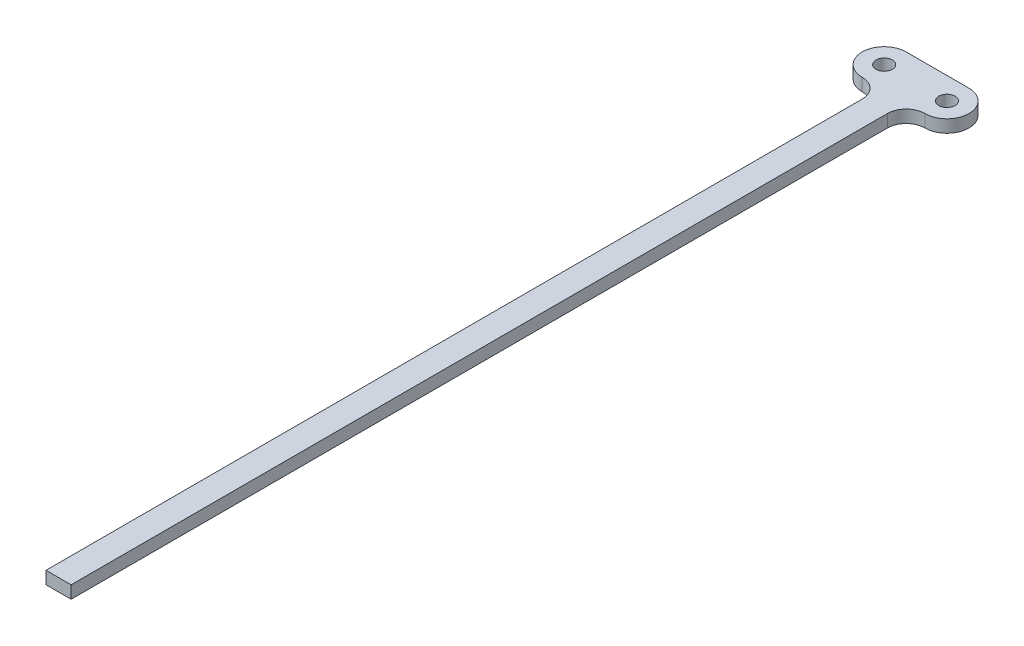
ISO-10303-21;
HEADER;
FILE_DESCRIPTION(('STEP AP214'),'2;1');
FILE_NAME('part.step','',(''),(''),'','','');
FILE_SCHEMA(('AUTOMOTIVE_DESIGN { 1 0 10303 214 1 1 1 1 }'));
ENDSEC;
DATA;
#1=APPLICATION_CONTEXT('core data for automotive mechanical design processes');
#2=APPLICATION_PROTOCOL_DEFINITION('international standard','automotive_design',2000,#1);
#3=PRODUCT_CONTEXT('',#1,'mechanical');
#4=PRODUCT('Part','Part','',(#3));
#5=PRODUCT_RELATED_PRODUCT_CATEGORY('part','',(#4));
#6=PRODUCT_DEFINITION_FORMATION('','',#4);
#7=PRODUCT_DEFINITION_CONTEXT('part definition',#1,'design');
#8=PRODUCT_DEFINITION('design','',#6,#7);
#9=PRODUCT_DEFINITION_SHAPE('','',#8);
#10=(LENGTH_UNIT() NAMED_UNIT(*) SI_UNIT(.MILLI.,.METRE.));
#11=(NAMED_UNIT(*) PLANE_ANGLE_UNIT() SI_UNIT($,.RADIAN.));
#12=(NAMED_UNIT(*) SI_UNIT($,.STERADIAN.) SOLID_ANGLE_UNIT());
#13=UNCERTAINTY_MEASURE_WITH_UNIT(LENGTH_MEASURE(1.E-05),#10,'distance_accuracy_value','');
#14=(GEOMETRIC_REPRESENTATION_CONTEXT(3) GLOBAL_UNCERTAINTY_ASSIGNED_CONTEXT((#13)) GLOBAL_UNIT_ASSIGNED_CONTEXT((#10,
#11,#12)) REPRESENTATION_CONTEXT('',''));
#15=CARTESIAN_POINT('',(0.,0.,0.));
#16=DIRECTION('',(0.,0.,1.));
#17=DIRECTION('',(1.,0.,0.));
#18=AXIS2_PLACEMENT_3D('',#15,#16,#17);
#19=CARTESIAN_POINT('',(-3.81,2.54,-165.1));
#20=DIRECTION('',(0.,1.,0.));
#21=DIRECTION('',(0.,0.,1.));
#22=AXIS2_PLACEMENT_3D('',#19,#20,#21);
#23=PLANE('',#22);
#24=CARTESIAN_POINT('',(8.89,2.54,-173.355));
#25=DIRECTION('',(0.,1.,0.));
#26=DIRECTION('',(0.,0.,1.));
#27=AXIS2_PLACEMENT_3D('',#24,#25,#26);
#28=CIRCLE('',#27,1.65099999999999);
#29=CARTESIAN_POINT('',(8.89,2.54,-171.704));
#30=VERTEX_POINT('',#29);
#31=EDGE_CURVE('E146',#30,#30,#28,.T.);
#32=ORIENTED_EDGE('',*,*,#31,.F.);
#33=EDGE_LOOP('',(#32));
#34=FACE_BOUND('',#33,.T.);
#35=DIRECTION('',(0.,0.,1.));
#36=VECTOR('',#35,1.);
#37=CARTESIAN_POINT('',(0.,2.54,0.));
#38=LINE('',#37,#36);
#39=CARTESIAN_POINT('',(0.,2.54,-165.1));
#40=VERTEX_POINT('',#39);
#41=CARTESIAN_POINT('',(0.,2.54,0.));
#42=VERTEX_POINT('',#41);
#43=EDGE_CURVE('E164',#40,#42,#38,.T.);
#44=ORIENTED_EDGE('',*,*,#43,.T.);
#45=DIRECTION('',(1.,0.,0.));
#46=VECTOR('',#45,1.);
#47=CARTESIAN_POINT('',(0.,2.54,0.));
#48=LINE('',#47,#46);
#49=CARTESIAN_POINT('',(5.08,2.54,0.));
#50=VERTEX_POINT('',#49);
#51=EDGE_CURVE('E100',#42,#50,#48,.T.);
#52=ORIENTED_EDGE('',*,*,#51,.T.);
#53=DIRECTION('',(0.,0.,-1.));
#54=VECTOR('',#53,1.);
#55=CARTESIAN_POINT('',(5.08,2.54,0.));
#56=LINE('',#55,#54);
#57=CARTESIAN_POINT('',(5.08,2.54,-165.1));
#58=VERTEX_POINT('',#57);
#59=EDGE_CURVE('E185',#50,#58,#56,.T.);
#60=ORIENTED_EDGE('',*,*,#59,.T.);
#61=CARTESIAN_POINT('',(8.89,2.54,-165.1));
#62=DIRECTION('',(0.,-1.,0.));
#63=DIRECTION('',(0.,0.,-1.));
#64=AXIS2_PLACEMENT_3D('',#61,#62,#63);
#65=CIRCLE('',#64,3.81);
#66=CARTESIAN_POINT('',(8.89,2.54,-168.91));
#67=VERTEX_POINT('',#66);
#68=EDGE_CURVE('E199',#58,#67,#65,.T.);
#69=ORIENTED_EDGE('',*,*,#68,.T.);
#70=CARTESIAN_POINT('',(8.89,2.54,-173.355));
#71=DIRECTION('',(0.,1.,0.));
#72=DIRECTION('',(0.,0.,1.));
#73=AXIS2_PLACEMENT_3D('',#70,#71,#72);
#74=CIRCLE('',#73,4.44499999999999);
#75=CARTESIAN_POINT('',(8.89,2.54,-177.8));
#76=VERTEX_POINT('',#75);
#77=EDGE_CURVE('E119',#67,#76,#74,.T.);
#78=ORIENTED_EDGE('',*,*,#77,.T.);
#79=DIRECTION('',(-1.,0.,0.));
#80=VECTOR('',#79,1.);
#81=CARTESIAN_POINT('',(-3.81,2.54,-177.8));
#82=LINE('',#81,#80);
#83=CARTESIAN_POINT('',(-3.81,2.54,-177.8));
#84=VERTEX_POINT('',#83);
#85=EDGE_CURVE('E113',#76,#84,#82,.T.);
#86=ORIENTED_EDGE('',*,*,#85,.T.);
#87=CARTESIAN_POINT('',(-3.81,2.54,-173.355));
#88=DIRECTION('',(0.,1.,0.));
#89=DIRECTION('',(0.,0.,-1.));
#90=AXIS2_PLACEMENT_3D('',#87,#88,#89);
#91=CIRCLE('',#90,4.44499999999999);
#92=CARTESIAN_POINT('',(-3.81,2.54,-168.91));
#93=VERTEX_POINT('',#92);
#94=EDGE_CURVE('E117',#84,#93,#91,.T.);
#95=ORIENTED_EDGE('',*,*,#94,.T.);
#96=CARTESIAN_POINT('',(-3.81,2.54,-165.1));
#97=DIRECTION('',(0.,-1.,0.));
#98=DIRECTION('',(0.,0.,1.));
#99=AXIS2_PLACEMENT_3D('',#96,#97,#98);
#100=CIRCLE('',#99,3.81);
#101=EDGE_CURVE('E57',#93,#40,#100,.T.);
#102=ORIENTED_EDGE('',*,*,#101,.T.);
#103=EDGE_LOOP('',(#44,#52,#60,#69,#78,#86,#95,#102));
#104=FACE_BOUND('',#103,.T.);
#105=CARTESIAN_POINT('',(-3.81,2.54,-173.355));
#106=DIRECTION('',(0.,1.,0.));
#107=DIRECTION('',(0.,0.,1.));
#108=AXIS2_PLACEMENT_3D('',#105,#106,#107);
#109=CIRCLE('',#108,1.651);
#110=CARTESIAN_POINT('',(-3.81,2.54,-171.704));
#111=VERTEX_POINT('',#110);
#112=EDGE_CURVE('E213',#111,#111,#109,.T.);
#113=ORIENTED_EDGE('',*,*,#112,.F.);
#114=EDGE_LOOP('',(#113));
#115=FACE_BOUND('',#114,.T.);
#116=ADVANCED_FACE('F39',(#34,#104,#115),#23,.T.);
#117=CARTESIAN_POINT('',(-3.81,0.,-165.1));
#118=DIRECTION('',(0.,1.,0.));
#119=DIRECTION('',(0.,0.,1.));
#120=AXIS2_PLACEMENT_3D('',#117,#118,#119);
#121=PLANE('',#120);
#122=DIRECTION('',(0.,0.,1.));
#123=VECTOR('',#122,1.);
#124=CARTESIAN_POINT('',(0.,0.,0.));
#125=LINE('',#124,#123);
#126=CARTESIAN_POINT('',(0.,0.,-165.1));
#127=VERTEX_POINT('',#126);
#128=CARTESIAN_POINT('',(0.,0.,0.));
#129=VERTEX_POINT('',#128);
#130=EDGE_CURVE('E141',#127,#129,#125,.T.);
#131=ORIENTED_EDGE('',*,*,#130,.F.);
#132=CARTESIAN_POINT('',(-3.81,0.,-165.1));
#133=DIRECTION('',(0.,-1.,0.));
#134=DIRECTION('',(0.,0.,1.));
#135=AXIS2_PLACEMENT_3D('',#132,#133,#134);
#136=CIRCLE('',#135,3.81);
#137=CARTESIAN_POINT('',(-3.81,0.,-168.91));
#138=VERTEX_POINT('',#137);
#139=EDGE_CURVE('E92',#138,#127,#136,.T.);
#140=ORIENTED_EDGE('',*,*,#139,.F.);
#141=CARTESIAN_POINT('',(-3.81,0.,-173.355));
#142=DIRECTION('',(0.,1.,0.));
#143=DIRECTION('',(0.,0.,-1.));
#144=AXIS2_PLACEMENT_3D('',#141,#142,#143);
#145=CIRCLE('',#144,4.44499999999999);
#146=CARTESIAN_POINT('',(-3.81,0.,-177.8));
#147=VERTEX_POINT('',#146);
#148=EDGE_CURVE('E86',#147,#138,#145,.T.);
#149=ORIENTED_EDGE('',*,*,#148,.F.);
#150=DIRECTION('',(-1.,0.,0.));
#151=VECTOR('',#150,1.);
#152=CARTESIAN_POINT('',(-3.81,0.,-177.8));
#153=LINE('',#152,#151);
#154=CARTESIAN_POINT('',(8.89,0.,-177.8));
#155=VERTEX_POINT('',#154);
#156=EDGE_CURVE('E128',#155,#147,#153,.T.);
#157=ORIENTED_EDGE('',*,*,#156,.F.);
#158=CARTESIAN_POINT('',(8.89,0.,-173.355));
#159=DIRECTION('',(0.,1.,0.));
#160=DIRECTION('',(0.,0.,1.));
#161=AXIS2_PLACEMENT_3D('',#158,#159,#160);
#162=CIRCLE('',#161,4.44499999999999);
#163=CARTESIAN_POINT('',(8.89,0.,-168.91));
#164=VERTEX_POINT('',#163);
#165=EDGE_CURVE('E155',#164,#155,#162,.T.);
#166=ORIENTED_EDGE('',*,*,#165,.F.);
#167=CARTESIAN_POINT('',(8.89,0.,-165.1));
#168=DIRECTION('',(0.,-1.,0.));
#169=DIRECTION('',(0.,0.,-1.));
#170=AXIS2_PLACEMENT_3D('',#167,#168,#169);
#171=CIRCLE('',#170,3.81);
#172=CARTESIAN_POINT('',(5.08,0.,-165.1));
#173=VERTEX_POINT('',#172);
#174=EDGE_CURVE('E152',#173,#164,#171,.T.);
#175=ORIENTED_EDGE('',*,*,#174,.F.);
#176=DIRECTION('',(0.,0.,-1.));
#177=VECTOR('',#176,1.);
#178=CARTESIAN_POINT('',(5.08,0.,0.));
#179=LINE('',#178,#177);
#180=CARTESIAN_POINT('',(5.08,0.,0.));
#181=VERTEX_POINT('',#180);
#182=EDGE_CURVE('E149',#181,#173,#179,.T.);
#183=ORIENTED_EDGE('',*,*,#182,.F.);
#184=DIRECTION('',(1.,0.,0.));
#185=VECTOR('',#184,1.);
#186=CARTESIAN_POINT('',(0.,0.,0.));
#187=LINE('',#186,#185);
#188=EDGE_CURVE('E145',#129,#181,#187,.T.);
#189=ORIENTED_EDGE('',*,*,#188,.F.);
#190=EDGE_LOOP('',(#131,#140,#149,#157,#166,#175,#183,#189));
#191=FACE_BOUND('',#190,.T.);
#192=CARTESIAN_POINT('',(8.89,0.,-173.355));
#193=DIRECTION('',(0.,1.,0.));
#194=DIRECTION('',(0.,0.,1.));
#195=AXIS2_PLACEMENT_3D('',#192,#193,#194);
#196=CIRCLE('',#195,1.65099999999999);
#197=CARTESIAN_POINT('',(8.89,0.,-171.704));
#198=VERTEX_POINT('',#197);
#199=EDGE_CURVE('E209',#198,#198,#196,.T.);
#200=ORIENTED_EDGE('',*,*,#199,.T.);
#201=EDGE_LOOP('',(#200));
#202=FACE_BOUND('',#201,.T.);
#203=CARTESIAN_POINT('',(-3.81,0.,-173.355));
#204=DIRECTION('',(0.,1.,0.));
#205=DIRECTION('',(0.,0.,1.));
#206=AXIS2_PLACEMENT_3D('',#203,#204,#205);
#207=CIRCLE('',#206,1.651);
#208=CARTESIAN_POINT('',(-3.81,0.,-171.704));
#209=VERTEX_POINT('',#208);
#210=EDGE_CURVE('E217',#209,#209,#207,.T.);
#211=ORIENTED_EDGE('',*,*,#210,.T.);
#212=EDGE_LOOP('',(#211));
#213=FACE_BOUND('',#212,.T.);
#214=ADVANCED_FACE('F189',(#191,#202,#213),#121,.F.);
#215=CARTESIAN_POINT('',(0.,2.54,0.));
#216=DIRECTION('',(1.,0.,0.));
#217=DIRECTION('',(0.,0.,-1.));
#218=AXIS2_PLACEMENT_3D('',#215,#216,#217);
#219=PLANE('',#218);
#220=ORIENTED_EDGE('',*,*,#130,.T.);
#221=DIRECTION('',(0.,-1.,0.));
#222=VECTOR('',#221,1.);
#223=CARTESIAN_POINT('',(0.,2.54,0.));
#224=LINE('',#223,#222);
#225=EDGE_CURVE('E11',#42,#129,#224,.T.);
#226=ORIENTED_EDGE('',*,*,#225,.F.);
#227=ORIENTED_EDGE('',*,*,#43,.F.);
#228=DIRECTION('',(0.,-1.,0.));
#229=VECTOR('',#228,1.);
#230=CARTESIAN_POINT('',(0.,2.54,-165.1));
#231=LINE('',#230,#229);
#232=EDGE_CURVE('E137',#40,#127,#231,.T.);
#233=ORIENTED_EDGE('',*,*,#232,.T.);
#234=EDGE_LOOP('',(#220,#226,#227,#233));
#235=FACE_BOUND('',#234,.T.);
#236=ADVANCED_FACE('F41',(#235),#219,.F.);
#237=CARTESIAN_POINT('',(0.,2.54,0.));
#238=DIRECTION('',(0.,0.,-1.));
#239=DIRECTION('',(-1.,0.,0.));
#240=AXIS2_PLACEMENT_3D('',#237,#238,#239);
#241=PLANE('',#240);
#242=ORIENTED_EDGE('',*,*,#188,.T.);
#243=DIRECTION('',(0.,-1.,0.));
#244=VECTOR('',#243,1.);
#245=CARTESIAN_POINT('',(5.08,2.54,0.));
#246=LINE('',#245,#244);
#247=EDGE_CURVE('E49',#50,#181,#246,.T.);
#248=ORIENTED_EDGE('',*,*,#247,.F.);
#249=ORIENTED_EDGE('',*,*,#51,.F.);
#250=ORIENTED_EDGE('',*,*,#225,.T.);
#251=EDGE_LOOP('',(#242,#248,#249,#250));
#252=FACE_BOUND('',#251,.T.);
#253=ADVANCED_FACE('F251',(#252),#241,.F.);
#254=CARTESIAN_POINT('',(5.08,2.54,0.));
#255=DIRECTION('',(-1.,0.,0.));
#256=DIRECTION('',(0.,0.,1.));
#257=AXIS2_PLACEMENT_3D('',#254,#255,#256);
#258=PLANE('',#257);
#259=ORIENTED_EDGE('',*,*,#182,.T.);
#260=DIRECTION('',(0.,-1.,0.));
#261=VECTOR('',#260,1.);
#262=CARTESIAN_POINT('',(5.08,2.54,-165.1));
#263=LINE('',#262,#261);
#264=EDGE_CURVE('E175',#58,#173,#263,.T.);
#265=ORIENTED_EDGE('',*,*,#264,.F.);
#266=ORIENTED_EDGE('',*,*,#59,.F.);
#267=ORIENTED_EDGE('',*,*,#247,.T.);
#268=EDGE_LOOP('',(#259,#265,#266,#267));
#269=FACE_BOUND('',#268,.T.);
#270=ADVANCED_FACE('F183',(#269),#258,.F.);
#271=CARTESIAN_POINT('',(8.89,2.54,-165.1));
#272=DIRECTION('',(0.,-1.,0.));
#273=DIRECTION('',(0.,0.,-1.));
#274=AXIS2_PLACEMENT_3D('',#271,#272,#273);
#275=CYLINDRICAL_SURFACE('',#274,3.81);
#276=ORIENTED_EDGE('',*,*,#174,.T.);
#277=DIRECTION('',(0.,-1.,0.));
#278=VECTOR('',#277,1.);
#279=CARTESIAN_POINT('',(8.89,2.54,-168.91));
#280=LINE('',#279,#278);
#281=EDGE_CURVE('E171',#67,#164,#280,.T.);
#282=ORIENTED_EDGE('',*,*,#281,.F.);
#283=ORIENTED_EDGE('',*,*,#68,.F.);
#284=ORIENTED_EDGE('',*,*,#264,.T.);
#285=EDGE_LOOP('',(#276,#282,#283,#284));
#286=FACE_BOUND('',#285,.T.);
#287=ADVANCED_FACE('F194',(#286),#275,.F.);
#288=CARTESIAN_POINT('',(8.89,2.54,-173.355));
#289=DIRECTION('',(0.,-1.,0.));
#290=DIRECTION('',(0.,0.,-1.));
#291=AXIS2_PLACEMENT_3D('',#288,#289,#290);
#292=CYLINDRICAL_SURFACE('',#291,4.44499999999999);
#293=ORIENTED_EDGE('',*,*,#165,.T.);
#294=DIRECTION('',(0.,-1.,0.));
#295=VECTOR('',#294,1.);
#296=CARTESIAN_POINT('',(8.89,2.54,-177.8));
#297=LINE('',#296,#295);
#298=EDGE_CURVE('E130',#76,#155,#297,.T.);
#299=ORIENTED_EDGE('',*,*,#298,.F.);
#300=ORIENTED_EDGE('',*,*,#77,.F.);
#301=ORIENTED_EDGE('',*,*,#281,.T.);
#302=EDGE_LOOP('',(#293,#299,#300,#301));
#303=FACE_BOUND('',#302,.T.);
#304=ADVANCED_FACE('F197',(#303),#292,.T.);
#305=CARTESIAN_POINT('',(-3.81,2.54,-177.8));
#306=DIRECTION('',(0.,0.,1.));
#307=DIRECTION('',(1.,0.,0.));
#308=AXIS2_PLACEMENT_3D('',#305,#306,#307);
#309=PLANE('',#308);
#310=ORIENTED_EDGE('',*,*,#156,.T.);
#311=DIRECTION('',(0.,-1.,0.));
#312=VECTOR('',#311,1.);
#313=CARTESIAN_POINT('',(-3.81,2.54,-177.8));
#314=LINE('',#313,#312);
#315=EDGE_CURVE('E125',#84,#147,#314,.T.);
#316=ORIENTED_EDGE('',*,*,#315,.F.);
#317=ORIENTED_EDGE('',*,*,#85,.F.);
#318=ORIENTED_EDGE('',*,*,#298,.T.);
#319=EDGE_LOOP('',(#310,#316,#317,#318));
#320=FACE_BOUND('',#319,.T.);
#321=ADVANCED_FACE('F126',(#320),#309,.F.);
#322=CARTESIAN_POINT('',(-3.81,2.54,-173.355));
#323=DIRECTION('',(0.,-1.,0.));
#324=DIRECTION('',(0.,0.,-1.));
#325=AXIS2_PLACEMENT_3D('',#322,#323,#324);
#326=CYLINDRICAL_SURFACE('',#325,4.44499999999999);
#327=ORIENTED_EDGE('',*,*,#148,.T.);
#328=DIRECTION('',(0.,-1.,0.));
#329=VECTOR('',#328,1.);
#330=CARTESIAN_POINT('',(-3.81,2.54,-168.91));
#331=LINE('',#330,#329);
#332=EDGE_CURVE('E131',#93,#138,#331,.T.);
#333=ORIENTED_EDGE('',*,*,#332,.F.);
#334=ORIENTED_EDGE('',*,*,#94,.F.);
#335=ORIENTED_EDGE('',*,*,#315,.T.);
#336=EDGE_LOOP('',(#327,#333,#334,#335));
#337=FACE_BOUND('',#336,.T.);
#338=ADVANCED_FACE('F133',(#337),#326,.T.);
#339=CARTESIAN_POINT('',(-3.81,2.54,-165.1));
#340=DIRECTION('',(0.,-1.,0.));
#341=DIRECTION('',(0.,0.,-1.));
#342=AXIS2_PLACEMENT_3D('',#339,#340,#341);
#343=CYLINDRICAL_SURFACE('',#342,3.81);
#344=ORIENTED_EDGE('',*,*,#139,.T.);
#345=ORIENTED_EDGE('',*,*,#232,.F.);
#346=ORIENTED_EDGE('',*,*,#101,.F.);
#347=ORIENTED_EDGE('',*,*,#332,.T.);
#348=EDGE_LOOP('',(#344,#345,#346,#347));
#349=FACE_BOUND('',#348,.T.);
#350=ADVANCED_FACE('F239',(#349),#343,.F.);
#351=CARTESIAN_POINT('',(8.89,2.54,-173.355));
#352=DIRECTION('',(0.,-1.,0.));
#353=DIRECTION('',(0.,0.,-1.));
#354=AXIS2_PLACEMENT_3D('',#351,#352,#353);
#355=CYLINDRICAL_SURFACE('',#354,1.65099999999999);
#356=ORIENTED_EDGE('',*,*,#31,.T.);
#357=EDGE_LOOP('',(#356));
#358=FACE_BOUND('',#357,.T.);
#359=ORIENTED_EDGE('',*,*,#199,.F.);
#360=EDGE_LOOP('',(#359));
#361=FACE_BOUND('',#360,.T.);
#362=ADVANCED_FACE('F236',(#358,#361),#355,.F.);
#363=CARTESIAN_POINT('',(-3.81,2.54,-173.355));
#364=DIRECTION('',(0.,-1.,0.));
#365=DIRECTION('',(0.,0.,-1.));
#366=AXIS2_PLACEMENT_3D('',#363,#364,#365);
#367=CYLINDRICAL_SURFACE('',#366,1.651);
#368=ORIENTED_EDGE('',*,*,#112,.T.);
#369=EDGE_LOOP('',(#368));
#370=FACE_BOUND('',#369,.T.);
#371=ORIENTED_EDGE('',*,*,#210,.F.);
#372=EDGE_LOOP('',(#371));
#373=FACE_BOUND('',#372,.T.);
#374=ADVANCED_FACE('F225',(#370,#373),#367,.F.);
#375=CLOSED_SHELL('',(#116,#214,#236,#253,#270,#287,#304,#321,#338,#350,#362,#374));
#376=MANIFOLD_SOLID_BREP('B2',#375);
#377=ADVANCED_BREP_SHAPE_REPRESENTATION('',(#18,#376),#14);
#378=SHAPE_DEFINITION_REPRESENTATION(#9,#377);
ENDSEC;
END-ISO-10303-21;
